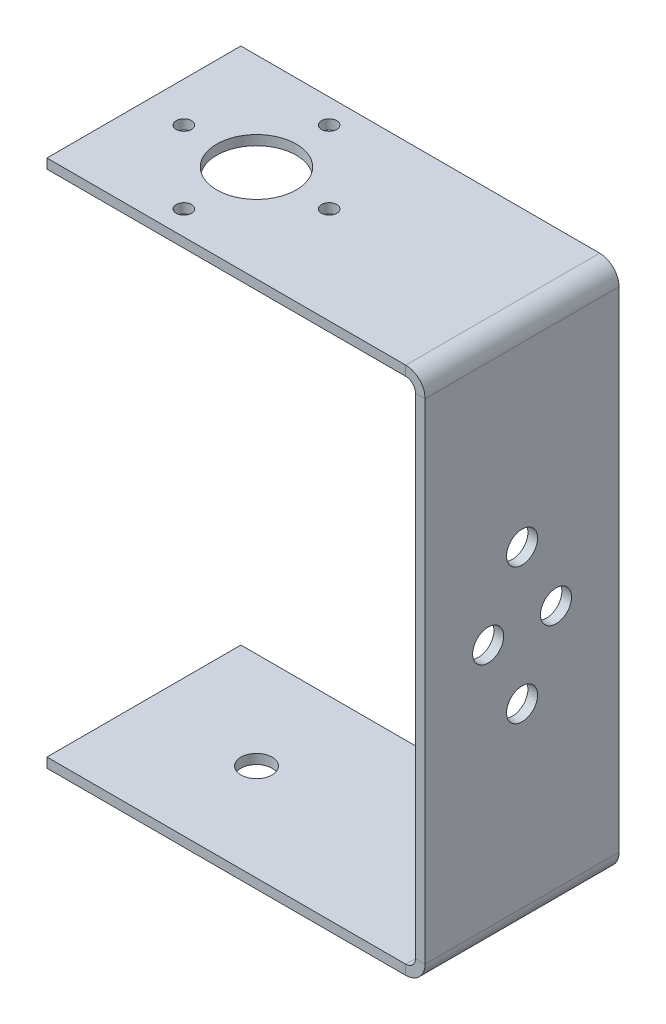
ISO-10303-21;
HEADER;
FILE_DESCRIPTION(('STEP AP214'),'2;1');
FILE_NAME('part.step','',(''),(''),'','','');
FILE_SCHEMA(('AUTOMOTIVE_DESIGN { 1 0 10303 214 1 1 1 1 }'));
ENDSEC;
DATA;
#1=APPLICATION_CONTEXT('core data for automotive mechanical design processes');
#2=APPLICATION_PROTOCOL_DEFINITION('international standard','automotive_design',2000,#1);
#3=PRODUCT_CONTEXT('',#1,'mechanical');
#4=PRODUCT('Part','Part','',(#3));
#5=PRODUCT_RELATED_PRODUCT_CATEGORY('part','',(#4));
#6=PRODUCT_DEFINITION_FORMATION('','',#4);
#7=PRODUCT_DEFINITION_CONTEXT('part definition',#1,'design');
#8=PRODUCT_DEFINITION('design','',#6,#7);
#9=PRODUCT_DEFINITION_SHAPE('','',#8);
#10=(LENGTH_UNIT() NAMED_UNIT(*) SI_UNIT(.MILLI.,.METRE.));
#11=(NAMED_UNIT(*) PLANE_ANGLE_UNIT() SI_UNIT($,.RADIAN.));
#12=(NAMED_UNIT(*) SI_UNIT($,.STERADIAN.) SOLID_ANGLE_UNIT());
#13=UNCERTAINTY_MEASURE_WITH_UNIT(LENGTH_MEASURE(1.E-05),#10,'distance_accuracy_value','');
#14=(GEOMETRIC_REPRESENTATION_CONTEXT(3) GLOBAL_UNCERTAINTY_ASSIGNED_CONTEXT((#13)) GLOBAL_UNIT_ASSIGNED_CONTEXT((#10,
#11,#12)) REPRESENTATION_CONTEXT('',''));
#15=CARTESIAN_POINT('',(0.,0.,0.));
#16=DIRECTION('',(0.,0.,1.));
#17=DIRECTION('',(1.,0.,0.));
#18=AXIS2_PLACEMENT_3D('',#15,#16,#17);
#19=CARTESIAN_POINT('',(-26.39,1.,-10.));
#20=DIRECTION('',(0.,-1.,0.));
#21=DIRECTION('',(0.,0.,-1.));
#22=AXIS2_PLACEMENT_3D('',#19,#20,#21);
#23=CYLINDRICAL_SURFACE('',#22,1.6);
#24=CARTESIAN_POINT('',(-26.39,1.,-10.));
#25=DIRECTION('',(0.,-1.,0.));
#26=DIRECTION('',(0.,0.,-1.));
#27=AXIS2_PLACEMENT_3D('',#24,#25,#26);
#28=CIRCLE('',#27,1.6);
#29=CARTESIAN_POINT('',(-26.39,1.,-11.6));
#30=VERTEX_POINT('',#29);
#31=EDGE_CURVE('E258',#30,#30,#28,.T.);
#32=ORIENTED_EDGE('',*,*,#31,.F.);
#33=EDGE_LOOP('',(#32));
#34=FACE_BOUND('',#33,.T.);
#35=CARTESIAN_POINT('',(-26.39,0.,-10.));
#36=DIRECTION('',(0.,-1.,0.));
#37=DIRECTION('',(0.,0.,-1.));
#38=AXIS2_PLACEMENT_3D('',#35,#36,#37);
#39=CIRCLE('',#38,1.6);
#40=CARTESIAN_POINT('',(-26.39,0.,-11.6));
#41=VERTEX_POINT('',#40);
#42=EDGE_CURVE('E186',#41,#41,#39,.T.);
#43=ORIENTED_EDGE('',*,*,#42,.T.);
#44=EDGE_LOOP('',(#43));
#45=FACE_BOUND('',#44,.T.);
#46=ADVANCED_FACE('F37',(#34,#45),#23,.F.);
#47=CARTESIAN_POINT('',(-38.,85.1189633792524,0.));
#48=DIRECTION('',(-1.,0.,0.));
#49=DIRECTION('',(0.,0.,-1.));
#50=AXIS2_PLACEMENT_3D('',#47,#48,#49);
#51=PLANE('',#50);
#52=DIRECTION('',(0.,0.,1.));
#53=VECTOR('',#52,1.);
#54=CARTESIAN_POINT('',(-38.,0.,0.));
#55=LINE('',#54,#53);
#56=CARTESIAN_POINT('',(-38.,0.,-20.));
#57=VERTEX_POINT('',#56);
#58=CARTESIAN_POINT('',(-38.,0.,0.));
#59=VERTEX_POINT('',#58);
#60=EDGE_CURVE('E71',#57,#59,#55,.T.);
#61=ORIENTED_EDGE('',*,*,#60,.T.);
#62=DIRECTION('',(0.,-1.,0.));
#63=VECTOR('',#62,1.);
#64=CARTESIAN_POINT('',(-38.,85.1189633792524,0.));
#65=LINE('',#64,#63);
#66=CARTESIAN_POINT('',(-38.,0.999999999999997,0.));
#67=VERTEX_POINT('',#66);
#68=EDGE_CURVE('E159',#67,#59,#65,.T.);
#69=ORIENTED_EDGE('',*,*,#68,.F.);
#70=DIRECTION('',(0.,0.,-1.));
#71=VECTOR('',#70,1.);
#72=CARTESIAN_POINT('',(-38.,1.,0.));
#73=LINE('',#72,#71);
#74=CARTESIAN_POINT('',(-38.,0.999999999999997,-20.));
#75=VERTEX_POINT('',#74);
#76=EDGE_CURVE('E56',#67,#75,#73,.T.);
#77=ORIENTED_EDGE('',*,*,#76,.T.);
#78=DIRECTION('',(0.,-1.,0.));
#79=VECTOR('',#78,1.);
#80=CARTESIAN_POINT('',(-38.,85.1189633792524,-20.));
#81=LINE('',#80,#79);
#82=EDGE_CURVE('E176',#75,#57,#81,.T.);
#83=ORIENTED_EDGE('',*,*,#82,.T.);
#84=EDGE_LOOP('',(#61,#69,#77,#83));
#85=FACE_BOUND('',#84,.T.);
#86=ADVANCED_FACE('F266',(#85),#51,.T.);
#87=CARTESIAN_POINT('',(-38.,85.1189633792524,-20.));
#88=DIRECTION('',(0.,0.,-1.));
#89=DIRECTION('',(1.,0.,0.));
#90=AXIS2_PLACEMENT_3D('',#87,#88,#89);
#91=PLANE('',#90);
#92=DIRECTION('',(-1.,0.,0.));
#93=VECTOR('',#92,1.);
#94=CARTESIAN_POINT('',(1.,0.,-20.));
#95=LINE('',#94,#93);
#96=CARTESIAN_POINT('',(-0.999999999999993,0.,-20.));
#97=VERTEX_POINT('',#96);
#98=EDGE_CURVE('E170',#97,#57,#95,.T.);
#99=ORIENTED_EDGE('',*,*,#98,.T.);
#100=ORIENTED_EDGE('',*,*,#82,.F.);
#101=DIRECTION('',(1.,0.,0.));
#102=VECTOR('',#101,1.);
#103=CARTESIAN_POINT('',(-38.,0.999999999999997,-20.));
#104=LINE('',#103,#102);
#105=CARTESIAN_POINT('',(-0.999999999999997,0.999999999999997,-20.));
#106=VERTEX_POINT('',#105);
#107=EDGE_CURVE('E175',#75,#106,#104,.T.);
#108=ORIENTED_EDGE('',*,*,#107,.T.);
#109=DIRECTION('',(0.,-1.,0.));
#110=VECTOR('',#109,1.);
#111=CARTESIAN_POINT('',(-1.,85.1189633792524,-20.));
#112=LINE('',#111,#110);
#113=EDGE_CURVE('E160',#106,#97,#112,.T.);
#114=ORIENTED_EDGE('',*,*,#113,.T.);
#115=EDGE_LOOP('',(#99,#100,#108,#114));
#116=FACE_BOUND('',#115,.T.);
#117=ADVANCED_FACE('F179',(#116),#91,.T.);
#118=CARTESIAN_POINT('',(1.,0.,0.));
#119=DIRECTION('',(0.,1.,0.));
#120=DIRECTION('',(0.,0.,1.));
#121=AXIS2_PLACEMENT_3D('',#118,#119,#120);
#122=PLANE('',#121);
#123=ORIENTED_EDGE('',*,*,#42,.F.);
#124=EDGE_LOOP('',(#123));
#125=FACE_BOUND('',#124,.T.);
#126=ORIENTED_EDGE('',*,*,#98,.F.);
#127=DIRECTION('',(0.,0.,1.));
#128=VECTOR('',#127,1.);
#129=CARTESIAN_POINT('',(-1.,0.,-20.));
#130=LINE('',#129,#128);
#131=CARTESIAN_POINT('',(-1.,0.,0.));
#132=VERTEX_POINT('',#131);
#133=EDGE_CURVE('E153',#97,#132,#130,.T.);
#134=ORIENTED_EDGE('',*,*,#133,.T.);
#135=DIRECTION('',(1.,0.,0.));
#136=VECTOR('',#135,1.);
#137=CARTESIAN_POINT('',(-38.,0.,0.));
#138=LINE('',#137,#136);
#139=EDGE_CURVE('E76',#59,#132,#138,.T.);
#140=ORIENTED_EDGE('',*,*,#139,.F.);
#141=ORIENTED_EDGE('',*,*,#60,.F.);
#142=EDGE_LOOP('',(#126,#134,#140,#141));
#143=FACE_BOUND('',#142,.T.);
#144=ADVANCED_FACE('F171',(#125,#143),#122,.F.);
#145=CARTESIAN_POINT('',(-38.,85.1189633792524,0.));
#146=DIRECTION('',(0.,0.,-1.));
#147=DIRECTION('',(1.,0.,0.));
#148=AXIS2_PLACEMENT_3D('',#145,#146,#147);
#149=PLANE('',#148);
#150=ORIENTED_EDGE('',*,*,#68,.T.);
#151=ORIENTED_EDGE('',*,*,#139,.T.);
#152=DIRECTION('',(0.,-1.,0.));
#153=VECTOR('',#152,1.);
#154=CARTESIAN_POINT('',(-1.,85.1189633792524,0.));
#155=LINE('',#154,#153);
#156=CARTESIAN_POINT('',(-0.999999999999998,1.,0.));
#157=VERTEX_POINT('',#156);
#158=EDGE_CURVE('E41',#157,#132,#155,.T.);
#159=ORIENTED_EDGE('',*,*,#158,.F.);
#160=DIRECTION('',(1.,0.,0.));
#161=VECTOR('',#160,1.);
#162=CARTESIAN_POINT('',(-38.,1.,0.));
#163=LINE('',#162,#161);
#164=EDGE_CURVE('E47',#67,#157,#163,.T.);
#165=ORIENTED_EDGE('',*,*,#164,.F.);
#166=EDGE_LOOP('',(#150,#151,#159,#165));
#167=FACE_BOUND('',#166,.T.);
#168=ADVANCED_FACE('F264',(#167),#149,.F.);
#169=CARTESIAN_POINT('',(-38.,1.,0.));
#170=DIRECTION('',(0.,-1.,0.));
#171=DIRECTION('',(0.,0.,-1.));
#172=AXIS2_PLACEMENT_3D('',#169,#170,#171);
#173=PLANE('',#172);
#174=ORIENTED_EDGE('',*,*,#31,.T.);
#175=EDGE_LOOP('',(#174));
#176=FACE_BOUND('',#175,.T.);
#177=ORIENTED_EDGE('',*,*,#164,.T.);
#178=DIRECTION('',(0.,0.,-1.));
#179=VECTOR('',#178,1.);
#180=CARTESIAN_POINT('',(-1.,0.999999999999997,-20.));
#181=LINE('',#180,#179);
#182=EDGE_CURVE('E11',#157,#106,#181,.T.);
#183=ORIENTED_EDGE('',*,*,#182,.T.);
#184=ORIENTED_EDGE('',*,*,#107,.F.);
#185=ORIENTED_EDGE('',*,*,#76,.F.);
#186=EDGE_LOOP('',(#177,#183,#184,#185));
#187=FACE_BOUND('',#186,.T.);
#188=ADVANCED_FACE('F39',(#176,#187),#173,.F.);
#189=CARTESIAN_POINT('',(-26.39,53.5,-10.));
#190=DIRECTION('',(0.,1.,0.));
#191=DIRECTION('',(0.,0.,1.));
#192=AXIS2_PLACEMENT_3D('',#189,#190,#191);
#193=CYLINDRICAL_SURFACE('',#192,4.1);
#194=CARTESIAN_POINT('',(-26.39,53.5,-10.));
#195=DIRECTION('',(0.,1.,0.));
#196=DIRECTION('',(0.,0.,1.));
#197=AXIS2_PLACEMENT_3D('',#194,#195,#196);
#198=CIRCLE('',#197,4.1);
#199=CARTESIAN_POINT('',(-26.39,53.5,-5.9));
#200=VERTEX_POINT('',#199);
#201=EDGE_CURVE('E198',#200,#200,#198,.T.);
#202=ORIENTED_EDGE('',*,*,#201,.F.);
#203=EDGE_LOOP('',(#202));
#204=FACE_BOUND('',#203,.T.);
#205=CARTESIAN_POINT('',(-26.39,54.5,-10.));
#206=DIRECTION('',(0.,1.,0.));
#207=DIRECTION('',(0.,0.,1.));
#208=AXIS2_PLACEMENT_3D('',#205,#206,#207);
#209=CIRCLE('',#208,4.1);
#210=CARTESIAN_POINT('',(-26.39,54.5,-5.9));
#211=VERTEX_POINT('',#210);
#212=EDGE_CURVE('E251',#211,#211,#209,.T.);
#213=ORIENTED_EDGE('',*,*,#212,.T.);
#214=EDGE_LOOP('',(#213));
#215=FACE_BOUND('',#214,.T.);
#216=ADVANCED_FACE('F286',(#204,#215),#193,.F.);
#217=CARTESIAN_POINT('',(-33.88,53.5,-10.));
#218=DIRECTION('',(0.,1.,0.));
#219=DIRECTION('',(0.,0.,1.));
#220=AXIS2_PLACEMENT_3D('',#217,#218,#219);
#221=CYLINDRICAL_SURFACE('',#220,0.789999999999999);
#222=CARTESIAN_POINT('',(-33.88,53.5,-10.));
#223=DIRECTION('',(0.,1.,0.));
#224=DIRECTION('',(0.,0.,1.));
#225=AXIS2_PLACEMENT_3D('',#222,#223,#224);
#226=CIRCLE('',#225,0.789999999999999);
#227=CARTESIAN_POINT('',(-33.88,53.5,-9.21));
#228=VERTEX_POINT('',#227);
#229=EDGE_CURVE('E207',#228,#228,#226,.T.);
#230=ORIENTED_EDGE('',*,*,#229,.F.);
#231=EDGE_LOOP('',(#230));
#232=FACE_BOUND('',#231,.T.);
#233=CARTESIAN_POINT('',(-33.88,54.5,-10.));
#234=DIRECTION('',(0.,1.,0.));
#235=DIRECTION('',(0.,0.,1.));
#236=AXIS2_PLACEMENT_3D('',#233,#234,#235);
#237=CIRCLE('',#236,0.789999999999999);
#238=CARTESIAN_POINT('',(-33.88,54.5,-9.21));
#239=VERTEX_POINT('',#238);
#240=EDGE_CURVE('E248',#239,#239,#237,.T.);
#241=ORIENTED_EDGE('',*,*,#240,.T.);
#242=EDGE_LOOP('',(#241));
#243=FACE_BOUND('',#242,.T.);
#244=ADVANCED_FACE('F291',(#232,#243),#221,.F.);
#245=CARTESIAN_POINT('',(-18.9,53.5,-10.));
#246=DIRECTION('',(0.,1.,0.));
#247=DIRECTION('',(0.,0.,1.));
#248=AXIS2_PLACEMENT_3D('',#245,#246,#247);
#249=CYLINDRICAL_SURFACE('',#248,0.790000000000002);
#250=CARTESIAN_POINT('',(-18.9,53.5,-10.));
#251=DIRECTION('',(0.,1.,0.));
#252=DIRECTION('',(0.,0.,1.));
#253=AXIS2_PLACEMENT_3D('',#250,#251,#252);
#254=CIRCLE('',#253,0.790000000000002);
#255=CARTESIAN_POINT('',(-18.9,53.5,-9.21));
#256=VERTEX_POINT('',#255);
#257=EDGE_CURVE('E210',#256,#256,#254,.T.);
#258=ORIENTED_EDGE('',*,*,#257,.F.);
#259=EDGE_LOOP('',(#258));
#260=FACE_BOUND('',#259,.T.);
#261=CARTESIAN_POINT('',(-18.9,54.5,-10.));
#262=DIRECTION('',(0.,1.,0.));
#263=DIRECTION('',(0.,0.,1.));
#264=AXIS2_PLACEMENT_3D('',#261,#262,#263);
#265=CIRCLE('',#264,0.790000000000002);
#266=CARTESIAN_POINT('',(-18.9,54.5,-9.21));
#267=VERTEX_POINT('',#266);
#268=EDGE_CURVE('E245',#267,#267,#265,.T.);
#269=ORIENTED_EDGE('',*,*,#268,.T.);
#270=EDGE_LOOP('',(#269));
#271=FACE_BOUND('',#270,.T.);
#272=ADVANCED_FACE('F432',(#260,#271),#249,.F.);
#273=CARTESIAN_POINT('',(-26.39,53.5,-2.51));
#274=DIRECTION('',(0.,1.,0.));
#275=DIRECTION('',(0.,0.,1.));
#276=AXIS2_PLACEMENT_3D('',#273,#274,#275);
#277=CYLINDRICAL_SURFACE('',#276,0.789999999999999);
#278=CARTESIAN_POINT('',(-26.39,53.5,-2.51));
#279=DIRECTION('',(0.,1.,0.));
#280=DIRECTION('',(0.,0.,1.));
#281=AXIS2_PLACEMENT_3D('',#278,#279,#280);
#282=CIRCLE('',#281,0.789999999999999);
#283=CARTESIAN_POINT('',(-26.39,53.5,-1.72));
#284=VERTEX_POINT('',#283);
#285=EDGE_CURVE('E213',#284,#284,#282,.T.);
#286=ORIENTED_EDGE('',*,*,#285,.F.);
#287=EDGE_LOOP('',(#286));
#288=FACE_BOUND('',#287,.T.);
#289=CARTESIAN_POINT('',(-26.39,54.5,-2.51));
#290=DIRECTION('',(0.,1.,0.));
#291=DIRECTION('',(0.,0.,1.));
#292=AXIS2_PLACEMENT_3D('',#289,#290,#291);
#293=CIRCLE('',#292,0.789999999999999);
#294=CARTESIAN_POINT('',(-26.39,54.5,-1.72));
#295=VERTEX_POINT('',#294);
#296=EDGE_CURVE('E242',#295,#295,#293,.T.);
#297=ORIENTED_EDGE('',*,*,#296,.T.);
#298=EDGE_LOOP('',(#297));
#299=FACE_BOUND('',#298,.T.);
#300=ADVANCED_FACE('F400',(#288,#299),#277,.F.);
#301=CARTESIAN_POINT('',(-26.39,53.5,-17.49));
#302=DIRECTION('',(0.,1.,0.));
#303=DIRECTION('',(0.,0.,1.));
#304=AXIS2_PLACEMENT_3D('',#301,#302,#303);
#305=CYLINDRICAL_SURFACE('',#304,0.789999999999999);
#306=CARTESIAN_POINT('',(-26.39,53.5,-17.49));
#307=DIRECTION('',(0.,1.,0.));
#308=DIRECTION('',(0.,0.,1.));
#309=AXIS2_PLACEMENT_3D('',#306,#307,#308);
#310=CIRCLE('',#309,0.789999999999999);
#311=CARTESIAN_POINT('',(-26.39,53.5,-16.7));
#312=VERTEX_POINT('',#311);
#313=EDGE_CURVE('E216',#312,#312,#310,.T.);
#314=ORIENTED_EDGE('',*,*,#313,.F.);
#315=EDGE_LOOP('',(#314));
#316=FACE_BOUND('',#315,.T.);
#317=CARTESIAN_POINT('',(-26.39,54.5,-17.49));
#318=DIRECTION('',(0.,1.,0.));
#319=DIRECTION('',(0.,0.,1.));
#320=AXIS2_PLACEMENT_3D('',#317,#318,#319);
#321=CIRCLE('',#320,0.789999999999999);
#322=CARTESIAN_POINT('',(-26.39,54.5,-16.7));
#323=VERTEX_POINT('',#322);
#324=EDGE_CURVE('E239',#323,#323,#321,.T.);
#325=ORIENTED_EDGE('',*,*,#324,.T.);
#326=EDGE_LOOP('',(#325));
#327=FACE_BOUND('',#326,.T.);
#328=ADVANCED_FACE('F393',(#316,#327),#305,.F.);
#329=CARTESIAN_POINT('',(-38.,-30.6189633792523,-20.));
#330=DIRECTION('',(-1.,0.,0.));
#331=DIRECTION('',(0.,-1.,0.));
#332=AXIS2_PLACEMENT_3D('',#329,#330,#331);
#333=PLANE('',#332);
#334=DIRECTION('',(0.,0.,-1.));
#335=VECTOR('',#334,1.);
#336=CARTESIAN_POINT('',(-38.,54.5,-20.));
#337=LINE('',#336,#335);
#338=CARTESIAN_POINT('',(-38.,54.5,0.));
#339=VERTEX_POINT('',#338);
#340=CARTESIAN_POINT('',(-38.,54.5,-20.));
#341=VERTEX_POINT('',#340);
#342=EDGE_CURVE('E99',#339,#341,#337,.T.);
#343=ORIENTED_EDGE('',*,*,#342,.T.);
#344=DIRECTION('',(0.,1.,0.));
#345=VECTOR('',#344,1.);
#346=CARTESIAN_POINT('',(-38.,-30.6189633792523,-20.));
#347=LINE('',#346,#345);
#348=CARTESIAN_POINT('',(-38.,53.5,-20.));
#349=VERTEX_POINT('',#348);
#350=EDGE_CURVE('E220',#349,#341,#347,.T.);
#351=ORIENTED_EDGE('',*,*,#350,.F.);
#352=DIRECTION('',(0.,0.,1.));
#353=VECTOR('',#352,1.);
#354=CARTESIAN_POINT('',(-38.,53.5,-20.));
#355=LINE('',#354,#353);
#356=CARTESIAN_POINT('',(-38.,53.5,0.));
#357=VERTEX_POINT('',#356);
#358=EDGE_CURVE('E84',#349,#357,#355,.T.);
#359=ORIENTED_EDGE('',*,*,#358,.T.);
#360=DIRECTION('',(0.,1.,0.));
#361=VECTOR('',#360,1.);
#362=CARTESIAN_POINT('',(-38.,-30.6189633792523,0.));
#363=LINE('',#362,#361);
#364=EDGE_CURVE('E234',#357,#339,#363,.T.);
#365=ORIENTED_EDGE('',*,*,#364,.T.);
#366=EDGE_LOOP('',(#343,#351,#359,#365));
#367=FACE_BOUND('',#366,.T.);
#368=ADVANCED_FACE('F392',(#367),#333,.T.);
#369=CARTESIAN_POINT('',(-38.,-30.6189633792523,0.));
#370=DIRECTION('',(0.,0.,1.));
#371=DIRECTION('',(0.,1.,0.));
#372=AXIS2_PLACEMENT_3D('',#369,#370,#371);
#373=PLANE('',#372);
#374=DIRECTION('',(-1.,0.,0.));
#375=VECTOR('',#374,1.);
#376=CARTESIAN_POINT('',(1.,54.5,0.));
#377=LINE('',#376,#375);
#378=CARTESIAN_POINT('',(-0.999999999999997,54.5,0.));
#379=VERTEX_POINT('',#378);
#380=EDGE_CURVE('E230',#379,#339,#377,.T.);
#381=ORIENTED_EDGE('',*,*,#380,.T.);
#382=ORIENTED_EDGE('',*,*,#364,.F.);
#383=DIRECTION('',(1.,0.,0.));
#384=VECTOR('',#383,1.);
#385=CARTESIAN_POINT('',(-38.,53.5,0.));
#386=LINE('',#385,#384);
#387=CARTESIAN_POINT('',(-0.999999999999999,53.5,0.));
#388=VERTEX_POINT('',#387);
#389=EDGE_CURVE('E228',#357,#388,#386,.T.);
#390=ORIENTED_EDGE('',*,*,#389,.T.);
#391=DIRECTION('',(0.,1.,0.));
#392=VECTOR('',#391,1.);
#393=CARTESIAN_POINT('',(-1.00000000000001,-30.6189633792523,0.));
#394=LINE('',#393,#392);
#395=EDGE_CURVE('E225',#388,#379,#394,.T.);
#396=ORIENTED_EDGE('',*,*,#395,.T.);
#397=EDGE_LOOP('',(#381,#382,#390,#396));
#398=FACE_BOUND('',#397,.T.);
#399=ADVANCED_FACE('F389',(#398),#373,.T.);
#400=CARTESIAN_POINT('',(1.,54.5,0.));
#401=DIRECTION('',(0.,-1.,0.));
#402=DIRECTION('',(0.,0.,-1.));
#403=AXIS2_PLACEMENT_3D('',#400,#401,#402);
#404=PLANE('',#403);
#405=ORIENTED_EDGE('',*,*,#324,.F.);
#406=EDGE_LOOP('',(#405));
#407=FACE_BOUND('',#406,.T.);
#408=ORIENTED_EDGE('',*,*,#296,.F.);
#409=EDGE_LOOP('',(#408));
#410=FACE_BOUND('',#409,.T.);
#411=ORIENTED_EDGE('',*,*,#268,.F.);
#412=EDGE_LOOP('',(#411));
#413=FACE_BOUND('',#412,.T.);
#414=ORIENTED_EDGE('',*,*,#240,.F.);
#415=EDGE_LOOP('',(#414));
#416=FACE_BOUND('',#415,.T.);
#417=ORIENTED_EDGE('',*,*,#212,.F.);
#418=EDGE_LOOP('',(#417));
#419=FACE_BOUND('',#418,.T.);
#420=ORIENTED_EDGE('',*,*,#380,.F.);
#421=DIRECTION('',(0.,0.,-1.));
#422=VECTOR('',#421,1.);
#423=CARTESIAN_POINT('',(-1.00000000000001,54.5,0.));
#424=LINE('',#423,#422);
#425=CARTESIAN_POINT('',(-1.,54.5,-20.));
#426=VERTEX_POINT('',#425);
#427=EDGE_CURVE('E223',#379,#426,#424,.T.);
#428=ORIENTED_EDGE('',*,*,#427,.T.);
#429=DIRECTION('',(1.,0.,0.));
#430=VECTOR('',#429,1.);
#431=CARTESIAN_POINT('',(-38.,54.5,-20.));
#432=LINE('',#431,#430);
#433=EDGE_CURVE('E103',#341,#426,#432,.T.);
#434=ORIENTED_EDGE('',*,*,#433,.F.);
#435=ORIENTED_EDGE('',*,*,#342,.F.);
#436=EDGE_LOOP('',(#420,#428,#434,#435));
#437=FACE_BOUND('',#436,.T.);
#438=ADVANCED_FACE('F386',(#407,#410,#413,#416,#419,#437),#404,.F.);
#439=CARTESIAN_POINT('',(-38.,-30.6189633792523,-20.));
#440=DIRECTION('',(0.,0.,1.));
#441=DIRECTION('',(0.,1.,0.));
#442=AXIS2_PLACEMENT_3D('',#439,#440,#441);
#443=PLANE('',#442);
#444=ORIENTED_EDGE('',*,*,#350,.T.);
#445=ORIENTED_EDGE('',*,*,#433,.T.);
#446=DIRECTION('',(0.,1.,0.));
#447=VECTOR('',#446,1.);
#448=CARTESIAN_POINT('',(-1.00000000000001,-30.6189633792523,-20.));
#449=LINE('',#448,#447);
#450=CARTESIAN_POINT('',(-0.999999999999999,53.5,-20.));
#451=VERTEX_POINT('',#450);
#452=EDGE_CURVE('E254',#451,#426,#449,.T.);
#453=ORIENTED_EDGE('',*,*,#452,.F.);
#454=DIRECTION('',(1.,0.,0.));
#455=VECTOR('',#454,1.);
#456=CARTESIAN_POINT('',(-38.,53.5,-20.));
#457=LINE('',#456,#455);
#458=EDGE_CURVE('E195',#349,#451,#457,.T.);
#459=ORIENTED_EDGE('',*,*,#458,.F.);
#460=EDGE_LOOP('',(#444,#445,#453,#459));
#461=FACE_BOUND('',#460,.T.);
#462=ADVANCED_FACE('F384',(#461),#443,.F.);
#463=CARTESIAN_POINT('',(-38.,53.5,-20.));
#464=DIRECTION('',(0.,1.,0.));
#465=DIRECTION('',(0.,0.,1.));
#466=AXIS2_PLACEMENT_3D('',#463,#464,#465);
#467=PLANE('',#466);
#468=ORIENTED_EDGE('',*,*,#313,.T.);
#469=EDGE_LOOP('',(#468));
#470=FACE_BOUND('',#469,.T.);
#471=ORIENTED_EDGE('',*,*,#285,.T.);
#472=EDGE_LOOP('',(#471));
#473=FACE_BOUND('',#472,.T.);
#474=ORIENTED_EDGE('',*,*,#257,.T.);
#475=EDGE_LOOP('',(#474));
#476=FACE_BOUND('',#475,.T.);
#477=ORIENTED_EDGE('',*,*,#229,.T.);
#478=EDGE_LOOP('',(#477));
#479=FACE_BOUND('',#478,.T.);
#480=ORIENTED_EDGE('',*,*,#201,.T.);
#481=EDGE_LOOP('',(#480));
#482=FACE_BOUND('',#481,.T.);
#483=ORIENTED_EDGE('',*,*,#458,.T.);
#484=DIRECTION('',(0.,0.,1.));
#485=VECTOR('',#484,1.);
#486=CARTESIAN_POINT('',(-1.00000000000001,53.5,0.));
#487=LINE('',#486,#485);
#488=EDGE_CURVE('E190',#451,#388,#487,.T.);
#489=ORIENTED_EDGE('',*,*,#488,.T.);
#490=ORIENTED_EDGE('',*,*,#389,.F.);
#491=ORIENTED_EDGE('',*,*,#358,.F.);
#492=EDGE_LOOP('',(#483,#489,#490,#491));
#493=FACE_BOUND('',#492,.T.);
#494=ADVANCED_FACE('F390',(#470,#473,#476,#479,#482,#493),#467,.F.);
#495=CARTESIAN_POINT('',(1.,0.,0.));
#496=DIRECTION('',(-1.,0.,0.));
#497=DIRECTION('',(0.,0.,1.));
#498=AXIS2_PLACEMENT_3D('',#495,#496,#497);
#499=PLANE('',#498);
#500=CARTESIAN_POINT('',(1.,20.25,-10.));
#501=DIRECTION('',(1.,0.,0.));
#502=DIRECTION('',(0.,0.,-1.));
#503=AXIS2_PLACEMENT_3D('',#500,#501,#502);
#504=CIRCLE('',#503,1.6);
#505=CARTESIAN_POINT('',(1.,20.25,-11.6));
#506=VERTEX_POINT('',#505);
#507=EDGE_CURVE('E342',#506,#506,#504,.T.);
#508=ORIENTED_EDGE('',*,*,#507,.F.);
#509=EDGE_LOOP('',(#508));
#510=FACE_BOUND('',#509,.T.);
#511=CARTESIAN_POINT('',(1.,27.25,-13.5));
#512=DIRECTION('',(1.,0.,0.));
#513=DIRECTION('',(0.,0.,-1.));
#514=AXIS2_PLACEMENT_3D('',#511,#512,#513);
#515=CIRCLE('',#514,1.6);
#516=CARTESIAN_POINT('',(1.,27.25,-15.1));
#517=VERTEX_POINT('',#516);
#518=EDGE_CURVE('E777',#517,#517,#515,.T.);
#519=ORIENTED_EDGE('',*,*,#518,.F.);
#520=EDGE_LOOP('',(#519));
#521=FACE_BOUND('',#520,.T.);
#522=CARTESIAN_POINT('',(1.,34.25,-10.));
#523=DIRECTION('',(1.,0.,0.));
#524=DIRECTION('',(0.,0.,-1.));
#525=AXIS2_PLACEMENT_3D('',#522,#523,#524);
#526=CIRCLE('',#525,1.6);
#527=CARTESIAN_POINT('',(1.,34.25,-11.6));
#528=VERTEX_POINT('',#527);
#529=EDGE_CURVE('E774',#528,#528,#526,.T.);
#530=ORIENTED_EDGE('',*,*,#529,.F.);
#531=EDGE_LOOP('',(#530));
#532=FACE_BOUND('',#531,.T.);
#533=CARTESIAN_POINT('',(1.,27.25,-6.5));
#534=DIRECTION('',(1.,0.,0.));
#535=DIRECTION('',(0.,0.,-1.));
#536=AXIS2_PLACEMENT_3D('',#533,#534,#535);
#537=CIRCLE('',#536,1.6);
#538=CARTESIAN_POINT('',(1.,27.25,-8.1));
#539=VERTEX_POINT('',#538);
#540=EDGE_CURVE('E772',#539,#539,#537,.T.);
#541=ORIENTED_EDGE('',*,*,#540,.F.);
#542=EDGE_LOOP('',(#541));
#543=FACE_BOUND('',#542,.T.);
#544=DIRECTION('',(0.,0.,1.));
#545=VECTOR('',#544,1.);
#546=CARTESIAN_POINT('',(1.,2.,-20.));
#547=LINE('',#546,#545);
#548=CARTESIAN_POINT('',(1.,2.,-20.));
#549=VERTEX_POINT('',#548);
#550=CARTESIAN_POINT('',(1.,2.,0.));
#551=VERTEX_POINT('',#550);
#552=EDGE_CURVE('E116',#549,#551,#547,.T.);
#553=ORIENTED_EDGE('',*,*,#552,.F.);
#554=DIRECTION('',(0.,1.,0.));
#555=VECTOR('',#554,1.);
#556=CARTESIAN_POINT('',(1.,0.,-20.));
#557=LINE('',#556,#555);
#558=CARTESIAN_POINT('',(1.,52.5,-20.));
#559=VERTEX_POINT('',#558);
#560=EDGE_CURVE('E339',#549,#559,#557,.T.);
#561=ORIENTED_EDGE('',*,*,#560,.T.);
#562=DIRECTION('',(0.,0.,-1.));
#563=VECTOR('',#562,1.);
#564=CARTESIAN_POINT('',(1.,52.5,0.));
#565=LINE('',#564,#563);
#566=CARTESIAN_POINT('',(1.,52.5,0.));
#567=VERTEX_POINT('',#566);
#568=EDGE_CURVE('E109',#567,#559,#565,.T.);
#569=ORIENTED_EDGE('',*,*,#568,.F.);
#570=DIRECTION('',(0.,-1.,0.));
#571=VECTOR('',#570,1.);
#572=CARTESIAN_POINT('',(1.,0.,0.));
#573=LINE('',#572,#571);
#574=EDGE_CURVE('E369',#567,#551,#573,.T.);
#575=ORIENTED_EDGE('',*,*,#574,.T.);
#576=EDGE_LOOP('',(#553,#561,#569,#575));
#577=FACE_BOUND('',#576,.T.);
#578=ADVANCED_FACE('F376',(#510,#521,#532,#543,#577),#499,.F.);
#579=CARTESIAN_POINT('',(0.,0.,0.));
#580=DIRECTION('',(-1.,0.,0.));
#581=DIRECTION('',(0.,0.,1.));
#582=AXIS2_PLACEMENT_3D('',#579,#580,#581);
#583=PLANE('',#582);
#584=CARTESIAN_POINT('',(0.,20.25,-10.));
#585=DIRECTION('',(1.,0.,0.));
#586=DIRECTION('',(0.,0.,-1.));
#587=AXIS2_PLACEMENT_3D('',#584,#585,#586);
#588=CIRCLE('',#587,1.6);
#589=CARTESIAN_POINT('',(0.,20.25,-11.6));
#590=VERTEX_POINT('',#589);
#591=EDGE_CURVE('E313',#590,#590,#588,.T.);
#592=ORIENTED_EDGE('',*,*,#591,.T.);
#593=EDGE_LOOP('',(#592));
#594=FACE_BOUND('',#593,.T.);
#595=CARTESIAN_POINT('',(0.,27.25,-13.5));
#596=DIRECTION('',(1.,0.,0.));
#597=DIRECTION('',(0.,0.,-1.));
#598=AXIS2_PLACEMENT_3D('',#595,#596,#597);
#599=CIRCLE('',#598,1.6);
#600=CARTESIAN_POINT('',(0.,27.25,-15.1));
#601=VERTEX_POINT('',#600);
#602=EDGE_CURVE('E320',#601,#601,#599,.T.);
#603=ORIENTED_EDGE('',*,*,#602,.T.);
#604=EDGE_LOOP('',(#603));
#605=FACE_BOUND('',#604,.T.);
#606=CARTESIAN_POINT('',(0.,34.25,-10.));
#607=DIRECTION('',(1.,0.,0.));
#608=DIRECTION('',(0.,0.,-1.));
#609=AXIS2_PLACEMENT_3D('',#606,#607,#608);
#610=CIRCLE('',#609,1.6);
#611=CARTESIAN_POINT('',(0.,34.25,-11.6));
#612=VERTEX_POINT('',#611);
#613=EDGE_CURVE('E323',#612,#612,#610,.T.);
#614=ORIENTED_EDGE('',*,*,#613,.T.);
#615=EDGE_LOOP('',(#614));
#616=FACE_BOUND('',#615,.T.);
#617=CARTESIAN_POINT('',(0.,27.25,-6.5));
#618=DIRECTION('',(1.,0.,0.));
#619=DIRECTION('',(0.,0.,-1.));
#620=AXIS2_PLACEMENT_3D('',#617,#618,#619);
#621=CIRCLE('',#620,1.6);
#622=CARTESIAN_POINT('',(0.,27.25,-8.1));
#623=VERTEX_POINT('',#622);
#624=EDGE_CURVE('E326',#623,#623,#621,.T.);
#625=ORIENTED_EDGE('',*,*,#624,.T.);
#626=EDGE_LOOP('',(#625));
#627=FACE_BOUND('',#626,.T.);
#628=DIRECTION('',(0.,1.,0.));
#629=VECTOR('',#628,1.);
#630=CARTESIAN_POINT('',(0.,0.,-20.));
#631=LINE('',#630,#629);
#632=CARTESIAN_POINT('',(0.,2.,-20.));
#633=VERTEX_POINT('',#632);
#634=CARTESIAN_POINT('',(0.,52.5,-20.));
#635=VERTEX_POINT('',#634);
#636=EDGE_CURVE('E329',#633,#635,#631,.T.);
#637=ORIENTED_EDGE('',*,*,#636,.F.);
#638=DIRECTION('',(0.,0.,1.));
#639=VECTOR('',#638,1.);
#640=CARTESIAN_POINT('',(0.,2.,-20.));
#641=LINE('',#640,#639);
#642=CARTESIAN_POINT('',(0.,2.,0.));
#643=VERTEX_POINT('',#642);
#644=EDGE_CURVE('E343',#633,#643,#641,.T.);
#645=ORIENTED_EDGE('',*,*,#644,.T.);
#646=DIRECTION('',(0.,-1.,0.));
#647=VECTOR('',#646,1.);
#648=CARTESIAN_POINT('',(0.,0.,0.));
#649=LINE('',#648,#647);
#650=CARTESIAN_POINT('',(0.,52.5,0.));
#651=VERTEX_POINT('',#650);
#652=EDGE_CURVE('E338',#651,#643,#649,.T.);
#653=ORIENTED_EDGE('',*,*,#652,.F.);
#654=DIRECTION('',(0.,0.,-1.));
#655=VECTOR('',#654,1.);
#656=CARTESIAN_POINT('',(0.,52.5,0.));
#657=LINE('',#656,#655);
#658=EDGE_CURVE('E353',#651,#635,#657,.T.);
#659=ORIENTED_EDGE('',*,*,#658,.T.);
#660=EDGE_LOOP('',(#637,#645,#653,#659));
#661=FACE_BOUND('',#660,.T.);
#662=ADVANCED_FACE('F359',(#594,#605,#616,#627,#661),#583,.T.);
#663=CARTESIAN_POINT('',(0.,27.25,-6.5));
#664=DIRECTION('',(1.,0.,0.));
#665=DIRECTION('',(0.,0.,-1.));
#666=AXIS2_PLACEMENT_3D('',#663,#664,#665);
#667=CYLINDRICAL_SURFACE('',#666,1.6);
#668=ORIENTED_EDGE('',*,*,#624,.F.);
#669=EDGE_LOOP('',(#668));
#670=FACE_BOUND('',#669,.T.);
#671=ORIENTED_EDGE('',*,*,#540,.T.);
#672=EDGE_LOOP('',(#671));
#673=FACE_BOUND('',#672,.T.);
#674=ADVANCED_FACE('F648',(#670,#673),#667,.F.);
#675=CARTESIAN_POINT('',(0.,34.25,-10.));
#676=DIRECTION('',(1.,0.,0.));
#677=DIRECTION('',(0.,0.,-1.));
#678=AXIS2_PLACEMENT_3D('',#675,#676,#677);
#679=CYLINDRICAL_SURFACE('',#678,1.6);
#680=ORIENTED_EDGE('',*,*,#613,.F.);
#681=EDGE_LOOP('',(#680));
#682=FACE_BOUND('',#681,.T.);
#683=ORIENTED_EDGE('',*,*,#529,.T.);
#684=EDGE_LOOP('',(#683));
#685=FACE_BOUND('',#684,.T.);
#686=ADVANCED_FACE('F637',(#682,#685),#679,.F.);
#687=CARTESIAN_POINT('',(0.,27.25,-13.5));
#688=DIRECTION('',(1.,0.,0.));
#689=DIRECTION('',(0.,0.,-1.));
#690=AXIS2_PLACEMENT_3D('',#687,#688,#689);
#691=CYLINDRICAL_SURFACE('',#690,1.6);
#692=ORIENTED_EDGE('',*,*,#602,.F.);
#693=EDGE_LOOP('',(#692));
#694=FACE_BOUND('',#693,.T.);
#695=ORIENTED_EDGE('',*,*,#518,.T.);
#696=EDGE_LOOP('',(#695));
#697=FACE_BOUND('',#696,.T.);
#698=ADVANCED_FACE('F626',(#694,#697),#691,.F.);
#699=CARTESIAN_POINT('',(0.,20.25,-10.));
#700=DIRECTION('',(1.,0.,0.));
#701=DIRECTION('',(0.,0.,-1.));
#702=AXIS2_PLACEMENT_3D('',#699,#700,#701);
#703=CYLINDRICAL_SURFACE('',#702,1.6);
#704=ORIENTED_EDGE('',*,*,#591,.F.);
#705=EDGE_LOOP('',(#704));
#706=FACE_BOUND('',#705,.T.);
#707=ORIENTED_EDGE('',*,*,#507,.T.);
#708=EDGE_LOOP('',(#707));
#709=FACE_BOUND('',#708,.T.);
#710=ADVANCED_FACE('F486',(#706,#709),#703,.F.);
#711=CARTESIAN_POINT('',(-108.632407687577,0.,-20.));
#712=DIRECTION('',(0.,0.,-1.));
#713=DIRECTION('',(-1.,0.,0.));
#714=AXIS2_PLACEMENT_3D('',#711,#712,#713);
#715=PLANE('',#714);
#716=ORIENTED_EDGE('',*,*,#560,.F.);
#717=DIRECTION('',(1.,0.,0.));
#718=VECTOR('',#717,1.);
#719=CARTESIAN_POINT('',(-108.632407687577,2.,-20.));
#720=LINE('',#719,#718);
#721=EDGE_CURVE('E167',#633,#549,#720,.T.);
#722=ORIENTED_EDGE('',*,*,#721,.F.);
#723=ORIENTED_EDGE('',*,*,#636,.T.);
#724=DIRECTION('',(1.,0.,0.));
#725=VECTOR('',#724,1.);
#726=CARTESIAN_POINT('',(-108.632407687577,52.5,-20.));
#727=LINE('',#726,#725);
#728=EDGE_CURVE('E347',#635,#559,#727,.T.);
#729=ORIENTED_EDGE('',*,*,#728,.T.);
#730=EDGE_LOOP('',(#716,#722,#723,#729));
#731=FACE_BOUND('',#730,.T.);
#732=ADVANCED_FACE('F379',(#731),#715,.T.);
#733=CARTESIAN_POINT('',(-108.632407687577,0.,0.));
#734=DIRECTION('',(0.,0.,1.));
#735=DIRECTION('',(1.,0.,0.));
#736=AXIS2_PLACEMENT_3D('',#733,#734,#735);
#737=PLANE('',#736);
#738=ORIENTED_EDGE('',*,*,#574,.F.);
#739=DIRECTION('',(1.,0.,0.));
#740=VECTOR('',#739,1.);
#741=CARTESIAN_POINT('',(-108.632407687577,52.5,0.));
#742=LINE('',#741,#740);
#743=EDGE_CURVE('E350',#651,#567,#742,.T.);
#744=ORIENTED_EDGE('',*,*,#743,.F.);
#745=ORIENTED_EDGE('',*,*,#652,.T.);
#746=DIRECTION('',(1.,0.,0.));
#747=VECTOR('',#746,1.);
#748=CARTESIAN_POINT('',(-108.632407687577,2.,0.));
#749=LINE('',#748,#747);
#750=EDGE_CURVE('E303',#643,#551,#749,.T.);
#751=ORIENTED_EDGE('',*,*,#750,.T.);
#752=EDGE_LOOP('',(#738,#744,#745,#751));
#753=FACE_BOUND('',#752,.T.);
#754=ADVANCED_FACE('F367',(#753),#737,.T.);
#755=CARTESIAN_POINT('',(-1.,52.5,-20.));
#756=DIRECTION('',(0.,0.,-1.));
#757=DIRECTION('',(-1.,0.,0.));
#758=AXIS2_PLACEMENT_3D('',#755,#756,#757);
#759=PLANE('',#758);
#760=ORIENTED_EDGE('',*,*,#728,.F.);
#761=CARTESIAN_POINT('',(-1.,52.5,-20.));
#762=DIRECTION('',(0.,0.,-1.));
#763=DIRECTION('',(-1.,0.,0.));
#764=AXIS2_PLACEMENT_3D('',#761,#762,#763);
#765=CIRCLE('',#764,1.);
#766=EDGE_CURVE('E311',#635,#451,#765,.F.);
#767=ORIENTED_EDGE('',*,*,#766,.T.);
#768=ORIENTED_EDGE('',*,*,#452,.T.);
#769=CARTESIAN_POINT('',(-1.,52.5,-20.));
#770=DIRECTION('',(0.,0.,-1.));
#771=DIRECTION('',(-1.,0.,0.));
#772=AXIS2_PLACEMENT_3D('',#769,#770,#771);
#773=CIRCLE('',#772,2.);
#774=EDGE_CURVE('E310',#559,#426,#773,.F.);
#775=ORIENTED_EDGE('',*,*,#774,.F.);
#776=EDGE_LOOP('',(#760,#767,#768,#775));
#777=FACE_BOUND('',#776,.T.);
#778=ADVANCED_FACE('F381',(#777),#759,.T.);
#779=CARTESIAN_POINT('',(-1.,52.5,0.));
#780=DIRECTION('',(0.,0.,1.));
#781=DIRECTION('',(1.,0.,0.));
#782=AXIS2_PLACEMENT_3D('',#779,#780,#781);
#783=PLANE('',#782);
#784=ORIENTED_EDGE('',*,*,#395,.F.);
#785=CARTESIAN_POINT('',(-1.,52.5,0.));
#786=DIRECTION('',(0.,0.,-1.));
#787=DIRECTION('',(-1.,0.,0.));
#788=AXIS2_PLACEMENT_3D('',#785,#786,#787);
#789=CIRCLE('',#788,1.);
#790=EDGE_CURVE('E314',#388,#651,#789,.T.);
#791=ORIENTED_EDGE('',*,*,#790,.T.);
#792=ORIENTED_EDGE('',*,*,#743,.T.);
#793=CARTESIAN_POINT('',(-1.,52.5,0.));
#794=DIRECTION('',(0.,0.,-1.));
#795=DIRECTION('',(-1.,0.,0.));
#796=AXIS2_PLACEMENT_3D('',#793,#794,#795);
#797=CIRCLE('',#796,2.);
#798=EDGE_CURVE('E308',#379,#567,#797,.T.);
#799=ORIENTED_EDGE('',*,*,#798,.F.);
#800=EDGE_LOOP('',(#784,#791,#792,#799));
#801=FACE_BOUND('',#800,.T.);
#802=ADVANCED_FACE('F372',(#801),#783,.T.);
#803=CARTESIAN_POINT('',(-1.,52.5,130.754890791963));
#804=DIRECTION('',(0.,0.,-1.));
#805=DIRECTION('',(-1.,0.,0.));
#806=AXIS2_PLACEMENT_3D('',#803,#804,#805);
#807=CYLINDRICAL_SURFACE('',#806,2.);
#808=ORIENTED_EDGE('',*,*,#798,.T.);
#809=ORIENTED_EDGE('',*,*,#568,.T.);
#810=ORIENTED_EDGE('',*,*,#774,.T.);
#811=ORIENTED_EDGE('',*,*,#427,.F.);
#812=EDGE_LOOP('',(#808,#809,#810,#811));
#813=FACE_BOUND('',#812,.T.);
#814=ADVANCED_FACE('F373',(#813),#807,.T.);
#815=CARTESIAN_POINT('',(-1.,52.5,130.754890791963));
#816=DIRECTION('',(0.,0.,-1.));
#817=DIRECTION('',(-1.,0.,0.));
#818=AXIS2_PLACEMENT_3D('',#815,#816,#817);
#819=CYLINDRICAL_SURFACE('',#818,1.);
#820=ORIENTED_EDGE('',*,*,#790,.F.);
#821=ORIENTED_EDGE('',*,*,#488,.F.);
#822=ORIENTED_EDGE('',*,*,#766,.F.);
#823=ORIENTED_EDGE('',*,*,#658,.F.);
#824=EDGE_LOOP('',(#820,#821,#822,#823));
#825=FACE_BOUND('',#824,.T.);
#826=ADVANCED_FACE('F364',(#825),#819,.F.);
#827=CARTESIAN_POINT('',(-1.,2.,0.));
#828=DIRECTION('',(0.,0.,1.));
#829=DIRECTION('',(0.,-1.,0.));
#830=AXIS2_PLACEMENT_3D('',#827,#828,#829);
#831=PLANE('',#830);
#832=ORIENTED_EDGE('',*,*,#750,.F.);
#833=CARTESIAN_POINT('',(-1.,2.,0.));
#834=DIRECTION('',(0.,0.,1.));
#835=DIRECTION('',(0.,-1.,0.));
#836=AXIS2_PLACEMENT_3D('',#833,#834,#835);
#837=CIRCLE('',#836,1.);
#838=EDGE_CURVE('E168',#643,#157,#837,.F.);
#839=ORIENTED_EDGE('',*,*,#838,.T.);
#840=ORIENTED_EDGE('',*,*,#158,.T.);
#841=CARTESIAN_POINT('',(-1.,2.,0.));
#842=DIRECTION('',(0.,0.,1.));
#843=DIRECTION('',(0.,-1.,0.));
#844=AXIS2_PLACEMENT_3D('',#841,#842,#843);
#845=CIRCLE('',#844,2.);
#846=EDGE_CURVE('E157',#551,#132,#845,.F.);
#847=ORIENTED_EDGE('',*,*,#846,.F.);
#848=EDGE_LOOP('',(#832,#839,#840,#847));
#849=FACE_BOUND('',#848,.T.);
#850=ADVANCED_FACE('F301',(#849),#831,.T.);
#851=CARTESIAN_POINT('',(-1.,2.,-20.));
#852=DIRECTION('',(0.,0.,-1.));
#853=DIRECTION('',(-1.,0.,0.));
#854=AXIS2_PLACEMENT_3D('',#851,#852,#853);
#855=PLANE('',#854);
#856=ORIENTED_EDGE('',*,*,#113,.F.);
#857=CARTESIAN_POINT('',(-1.,2.,-20.));
#858=DIRECTION('',(0.,0.,1.));
#859=DIRECTION('',(0.,-1.,0.));
#860=AXIS2_PLACEMENT_3D('',#857,#858,#859);
#861=CIRCLE('',#860,1.);
#862=EDGE_CURVE('E300',#106,#633,#861,.T.);
#863=ORIENTED_EDGE('',*,*,#862,.T.);
#864=ORIENTED_EDGE('',*,*,#721,.T.);
#865=CARTESIAN_POINT('',(-1.,2.,-20.));
#866=DIRECTION('',(0.,0.,1.));
#867=DIRECTION('',(0.,-1.,0.));
#868=AXIS2_PLACEMENT_3D('',#865,#866,#867);
#869=CIRCLE('',#868,2.);
#870=EDGE_CURVE('E156',#97,#549,#869,.T.);
#871=ORIENTED_EDGE('',*,*,#870,.F.);
#872=EDGE_LOOP('',(#856,#863,#864,#871));
#873=FACE_BOUND('',#872,.T.);
#874=ADVANCED_FACE('F163',(#873),#855,.T.);
#875=CARTESIAN_POINT('',(-1.,1.99999999999999,-121.777013447144));
#876=DIRECTION('',(0.,0.,1.));
#877=DIRECTION('',(0.,-1.,0.));
#878=AXIS2_PLACEMENT_3D('',#875,#876,#877);
#879=CYLINDRICAL_SURFACE('',#878,2.);
#880=ORIENTED_EDGE('',*,*,#870,.T.);
#881=ORIENTED_EDGE('',*,*,#552,.T.);
#882=ORIENTED_EDGE('',*,*,#846,.T.);
#883=ORIENTED_EDGE('',*,*,#133,.F.);
#884=EDGE_LOOP('',(#880,#881,#882,#883));
#885=FACE_BOUND('',#884,.T.);
#886=ADVANCED_FACE('F155',(#885),#879,.T.);
#887=CARTESIAN_POINT('',(-1.,1.99999999999999,-121.777013447144));
#888=DIRECTION('',(0.,0.,1.));
#889=DIRECTION('',(0.,-1.,0.));
#890=AXIS2_PLACEMENT_3D('',#887,#888,#889);
#891=CYLINDRICAL_SURFACE('',#890,1.);
#892=ORIENTED_EDGE('',*,*,#862,.F.);
#893=ORIENTED_EDGE('',*,*,#182,.F.);
#894=ORIENTED_EDGE('',*,*,#838,.F.);
#895=ORIENTED_EDGE('',*,*,#644,.F.);
#896=EDGE_LOOP('',(#892,#893,#894,#895));
#897=FACE_BOUND('',#896,.T.);
#898=ADVANCED_FACE('F297',(#897),#891,.F.);
#899=CLOSED_SHELL('',(#46,#86,#117,#144,#168,#188,#216,#244,#272,#300,#328,#368,#399,#438,#462,
#494,#578,#662,#674,#686,#698,#710,#732,#754,#778,#802,#814,#826,#850,#874,#886,#898));
#900=MANIFOLD_SOLID_BREP('B2',#899);
#901=ADVANCED_BREP_SHAPE_REPRESENTATION('',(#18,#900),#14);
#902=SHAPE_DEFINITION_REPRESENTATION(#9,#901);
ENDSEC;
END-ISO-10303-21;
